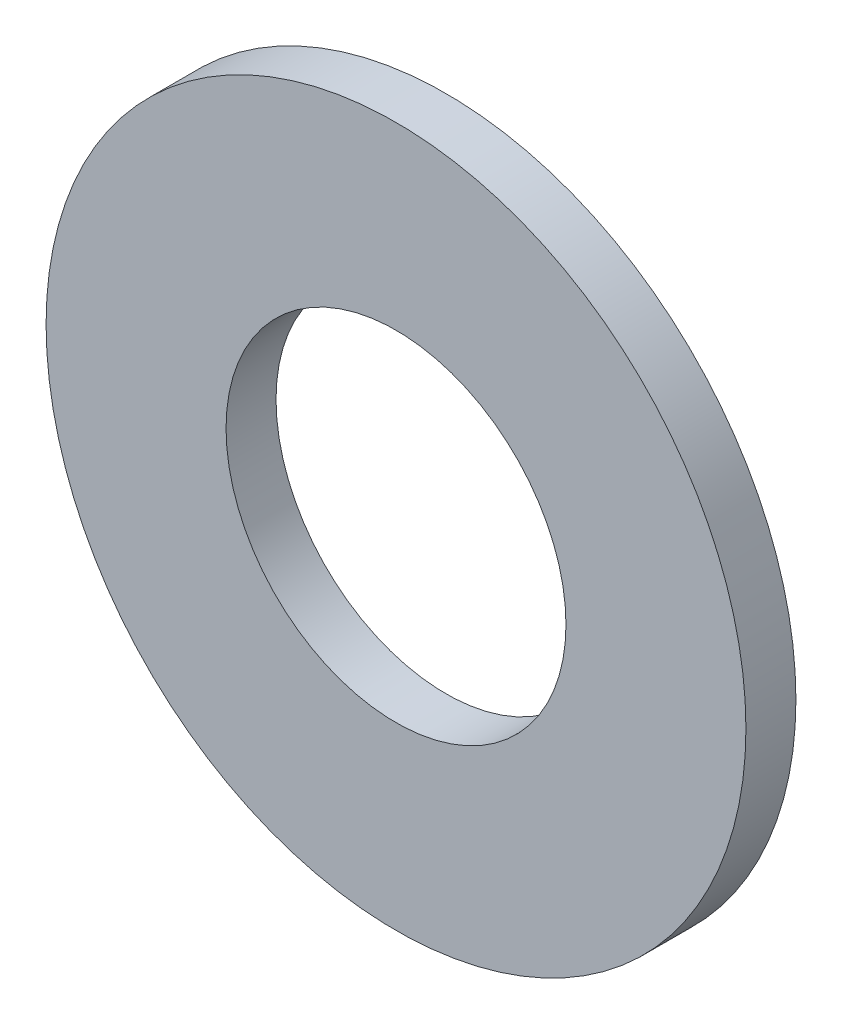
ISO-10303-21;
HEADER;
FILE_DESCRIPTION(('STEP AP214'),'2;1');
FILE_NAME('part.step','',(''),(''),'','','');
FILE_SCHEMA(('AUTOMOTIVE_DESIGN { 1 0 10303 214 1 1 1 1 }'));
ENDSEC;
DATA;
#1=APPLICATION_CONTEXT('core data for automotive mechanical design processes');
#2=APPLICATION_PROTOCOL_DEFINITION('international standard','automotive_design',2000,#1);
#3=PRODUCT_CONTEXT('',#1,'mechanical');
#4=PRODUCT('Part','Part','',(#3));
#5=PRODUCT_RELATED_PRODUCT_CATEGORY('part','',(#4));
#6=PRODUCT_DEFINITION_FORMATION('','',#4);
#7=PRODUCT_DEFINITION_CONTEXT('part definition',#1,'design');
#8=PRODUCT_DEFINITION('design','',#6,#7);
#9=PRODUCT_DEFINITION_SHAPE('','',#8);
#10=(LENGTH_UNIT() NAMED_UNIT(*) SI_UNIT(.MILLI.,.METRE.));
#11=(NAMED_UNIT(*) PLANE_ANGLE_UNIT() SI_UNIT($,.RADIAN.));
#12=(NAMED_UNIT(*) SI_UNIT($,.STERADIAN.) SOLID_ANGLE_UNIT());
#13=UNCERTAINTY_MEASURE_WITH_UNIT(LENGTH_MEASURE(1.E-05),#10,'distance_accuracy_value','');
#14=(GEOMETRIC_REPRESENTATION_CONTEXT(3) GLOBAL_UNCERTAINTY_ASSIGNED_CONTEXT((#13)) GLOBAL_UNIT_ASSIGNED_CONTEXT((#10,
#11,#12)) REPRESENTATION_CONTEXT('',''));
#15=CARTESIAN_POINT('',(0.,0.,0.));
#16=DIRECTION('',(0.,0.,1.));
#17=DIRECTION('',(1.,0.,0.));
#18=AXIS2_PLACEMENT_3D('',#15,#16,#17);
#19=CARTESIAN_POINT('',(0.,0.,-0.5));
#20=DIRECTION('',(0.,0.,1.));
#21=DIRECTION('',(1.,0.,0.));
#22=AXIS2_PLACEMENT_3D('',#19,#20,#21);
#23=CYLINDRICAL_SURFACE('',#22,3.5);
#24=CARTESIAN_POINT('',(0.,0.,-0.5));
#25=DIRECTION('',(0.,0.,1.));
#26=DIRECTION('',(1.,0.,0.));
#27=AXIS2_PLACEMENT_3D('',#24,#25,#26);
#28=CIRCLE('',#27,3.5);
#29=CARTESIAN_POINT('',(3.5,0.,-0.5));
#30=VERTEX_POINT('',#29);
#31=EDGE_CURVE('E10',#30,#30,#28,.T.);
#32=ORIENTED_EDGE('',*,*,#31,.T.);
#33=EDGE_LOOP('',(#32));
#34=FACE_BOUND('',#33,.T.);
#35=CARTESIAN_POINT('',(0.,0.,0.));
#36=DIRECTION('',(0.,0.,1.));
#37=DIRECTION('',(1.,0.,0.));
#38=AXIS2_PLACEMENT_3D('',#35,#36,#37);
#39=CIRCLE('',#38,3.5);
#40=CARTESIAN_POINT('',(3.5,0.,0.));
#41=VERTEX_POINT('',#40);
#42=EDGE_CURVE('E36',#41,#41,#39,.T.);
#43=ORIENTED_EDGE('',*,*,#42,.F.);
#44=EDGE_LOOP('',(#43));
#45=FACE_BOUND('',#44,.T.);
#46=ADVANCED_FACE('F33',(#34,#45),#23,.T.);
#47=CARTESIAN_POINT('',(0.,0.,-0.5));
#48=DIRECTION('',(0.,0.,1.));
#49=DIRECTION('',(1.,0.,0.));
#50=AXIS2_PLACEMENT_3D('',#47,#48,#49);
#51=PLANE('',#50);
#52=CARTESIAN_POINT('',(0.,0.,-0.5));
#53=DIRECTION('',(0.,0.,1.));
#54=DIRECTION('',(1.,0.,0.));
#55=AXIS2_PLACEMENT_3D('',#52,#53,#54);
#56=CIRCLE('',#55,1.7);
#57=CARTESIAN_POINT('',(1.7,0.,-0.5));
#58=VERTEX_POINT('',#57);
#59=EDGE_CURVE('E43',#58,#58,#56,.T.);
#60=ORIENTED_EDGE('',*,*,#59,.T.);
#61=EDGE_LOOP('',(#60));
#62=FACE_BOUND('',#61,.T.);
#63=ORIENTED_EDGE('',*,*,#31,.F.);
#64=EDGE_LOOP('',(#63));
#65=FACE_BOUND('',#64,.T.);
#66=ADVANCED_FACE('F51',(#62,#65),#51,.F.);
#67=CARTESIAN_POINT('',(0.,0.,0.));
#68=DIRECTION('',(0.,0.,1.));
#69=DIRECTION('',(1.,0.,0.));
#70=AXIS2_PLACEMENT_3D('',#67,#68,#69);
#71=PLANE('',#70);
#72=CARTESIAN_POINT('',(0.,0.,0.));
#73=DIRECTION('',(0.,0.,1.));
#74=DIRECTION('',(1.,0.,0.));
#75=AXIS2_PLACEMENT_3D('',#72,#73,#74);
#76=CIRCLE('',#75,1.7);
#77=CARTESIAN_POINT('',(1.7,0.,0.));
#78=VERTEX_POINT('',#77);
#79=EDGE_CURVE('E45',#78,#78,#76,.T.);
#80=ORIENTED_EDGE('',*,*,#79,.F.);
#81=EDGE_LOOP('',(#80));
#82=FACE_BOUND('',#81,.T.);
#83=ORIENTED_EDGE('',*,*,#42,.T.);
#84=EDGE_LOOP('',(#83));
#85=FACE_BOUND('',#84,.T.);
#86=ADVANCED_FACE('F57',(#82,#85),#71,.T.);
#87=CARTESIAN_POINT('',(0.,0.,-0.5));
#88=DIRECTION('',(0.,0.,1.));
#89=DIRECTION('',(1.,0.,0.));
#90=AXIS2_PLACEMENT_3D('',#87,#88,#89);
#91=CYLINDRICAL_SURFACE('',#90,1.7);
#92=ORIENTED_EDGE('',*,*,#59,.F.);
#93=EDGE_LOOP('',(#92));
#94=FACE_BOUND('',#93,.T.);
#95=ORIENTED_EDGE('',*,*,#79,.T.);
#96=EDGE_LOOP('',(#95));
#97=FACE_BOUND('',#96,.T.);
#98=ADVANCED_FACE('F54',(#94,#97),#91,.F.);
#99=CLOSED_SHELL('',(#46,#66,#86,#98));
#100=MANIFOLD_SOLID_BREP('B2',#99);
#101=ADVANCED_BREP_SHAPE_REPRESENTATION('',(#18,#100),#14);
#102=SHAPE_DEFINITION_REPRESENTATION(#9,#101);
ENDSEC;
END-ISO-10303-21;
